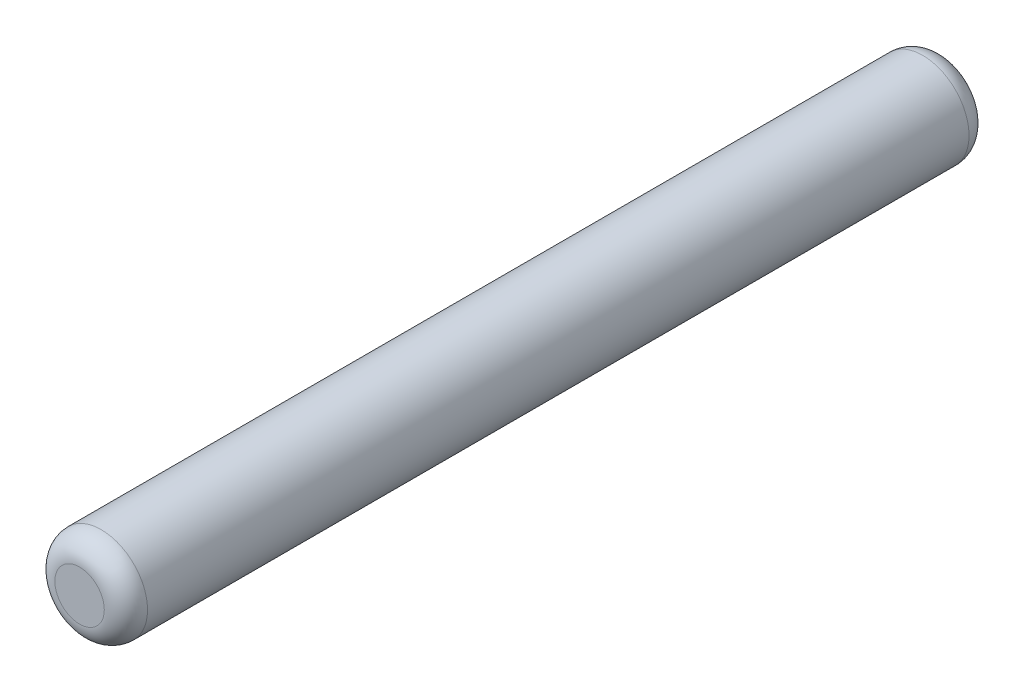
ISO-10303-21;
HEADER;
FILE_DESCRIPTION(('STEP AP214'),'2;1');
FILE_NAME('part.step','',(''),(''),'','','');
FILE_SCHEMA(('AUTOMOTIVE_DESIGN { 1 0 10303 214 1 1 1 1 }'));
ENDSEC;
DATA;
#1=APPLICATION_CONTEXT('core data for automotive mechanical design processes');
#2=APPLICATION_PROTOCOL_DEFINITION('international standard','automotive_design',2000,#1);
#3=PRODUCT_CONTEXT('',#1,'mechanical');
#4=PRODUCT('Part','Part','',(#3));
#5=PRODUCT_RELATED_PRODUCT_CATEGORY('part','',(#4));
#6=PRODUCT_DEFINITION_FORMATION('','',#4);
#7=PRODUCT_DEFINITION_CONTEXT('part definition',#1,'design');
#8=PRODUCT_DEFINITION('design','',#6,#7);
#9=PRODUCT_DEFINITION_SHAPE('','',#8);
#10=(LENGTH_UNIT() NAMED_UNIT(*) SI_UNIT(.MILLI.,.METRE.));
#11=(NAMED_UNIT(*) PLANE_ANGLE_UNIT() SI_UNIT($,.RADIAN.));
#12=(NAMED_UNIT(*) SI_UNIT($,.STERADIAN.) SOLID_ANGLE_UNIT());
#13=UNCERTAINTY_MEASURE_WITH_UNIT(LENGTH_MEASURE(1.E-05),#10,'distance_accuracy_value','');
#14=(GEOMETRIC_REPRESENTATION_CONTEXT(3) GLOBAL_UNCERTAINTY_ASSIGNED_CONTEXT((#13)) GLOBAL_UNIT_ASSIGNED_CONTEXT((#10,
#11,#12)) REPRESENTATION_CONTEXT('',''));
#15=CARTESIAN_POINT('',(0.,0.,0.));
#16=DIRECTION('',(0.,0.,1.));
#17=DIRECTION('',(1.,0.,0.));
#18=AXIS2_PLACEMENT_3D('',#15,#16,#17);
#19=CARTESIAN_POINT('',(0.,0.,7.));
#20=DIRECTION('',(0.,0.,-1.));
#21=DIRECTION('',(-1.,0.,0.));
#22=AXIS2_PLACEMENT_3D('',#19,#20,#21);
#23=CYLINDRICAL_SURFACE('',#22,0.75);
#24=CARTESIAN_POINT('',(0.,0.,-6.65));
#25=DIRECTION('',(0.,0.,1.));
#26=DIRECTION('',(1.,0.,0.));
#27=AXIS2_PLACEMENT_3D('',#24,#25,#26);
#28=CIRCLE('',#27,0.75);
#29=CARTESIAN_POINT('',(0.75,0.,-6.65));
#30=VERTEX_POINT('',#29);
#31=EDGE_CURVE('E42',#30,#30,#28,.T.);
#32=ORIENTED_EDGE('',*,*,#31,.T.);
#33=EDGE_LOOP('',(#32));
#34=FACE_BOUND('',#33,.T.);
#35=CARTESIAN_POINT('',(0.,0.,6.65));
#36=DIRECTION('',(0.,0.,1.));
#37=DIRECTION('',(1.,0.,0.));
#38=AXIS2_PLACEMENT_3D('',#35,#36,#37);
#39=CIRCLE('',#38,0.75);
#40=CARTESIAN_POINT('',(0.75,0.,6.65));
#41=VERTEX_POINT('',#40);
#42=EDGE_CURVE('E46',#41,#41,#39,.F.);
#43=ORIENTED_EDGE('',*,*,#42,.T.);
#44=EDGE_LOOP('',(#43));
#45=FACE_BOUND('',#44,.T.);
#46=ADVANCED_FACE('F31',(#34,#45),#23,.T.);
#47=CARTESIAN_POINT('',(0.,0.,7.));
#48=DIRECTION('',(0.,0.,1.));
#49=DIRECTION('',(1.,0.,0.));
#50=AXIS2_PLACEMENT_3D('',#47,#48,#49);
#51=PLANE('',#50);
#52=CARTESIAN_POINT('',(0.,0.,7.));
#53=DIRECTION('',(0.,0.,1.));
#54=DIRECTION('',(1.,0.,0.));
#55=AXIS2_PLACEMENT_3D('',#52,#53,#54);
#56=CIRCLE('',#55,0.4);
#57=CARTESIAN_POINT('',(0.4,0.,7.));
#58=VERTEX_POINT('',#57);
#59=EDGE_CURVE('E10',#58,#58,#56,.T.);
#60=ORIENTED_EDGE('',*,*,#59,.T.);
#61=EDGE_LOOP('',(#60));
#62=FACE_BOUND('',#61,.T.);
#63=ADVANCED_FACE('F62',(#62),#51,.T.);
#64=CARTESIAN_POINT('',(0.,0.,-7.));
#65=DIRECTION('',(0.,0.,1.));
#66=DIRECTION('',(1.,0.,0.));
#67=AXIS2_PLACEMENT_3D('',#64,#65,#66);
#68=PLANE('',#67);
#69=CARTESIAN_POINT('',(0.,0.,-7.));
#70=DIRECTION('',(0.,0.,1.));
#71=DIRECTION('',(1.,0.,0.));
#72=AXIS2_PLACEMENT_3D('',#69,#70,#71);
#73=CIRCLE('',#72,0.4);
#74=CARTESIAN_POINT('',(0.4,0.,-7.));
#75=VERTEX_POINT('',#74);
#76=EDGE_CURVE('E38',#75,#75,#73,.F.);
#77=ORIENTED_EDGE('',*,*,#76,.T.);
#78=EDGE_LOOP('',(#77));
#79=FACE_BOUND('',#78,.T.);
#80=ADVANCED_FACE('F59',(#79),#68,.F.);
#81=CARTESIAN_POINT('',(0.,0.,-6.65));
#82=DIRECTION('',(0.,0.,1.));
#83=DIRECTION('',(1.,0.,0.));
#84=AXIS2_PLACEMENT_3D('',#81,#82,#83);
#85=TOROIDAL_SURFACE('',#84,0.4,0.35);
#86=ORIENTED_EDGE('',*,*,#76,.F.);
#87=EDGE_LOOP('',(#86));
#88=FACE_BOUND('',#87,.T.);
#89=ORIENTED_EDGE('',*,*,#31,.F.);
#90=EDGE_LOOP('',(#89));
#91=FACE_BOUND('',#90,.T.);
#92=ADVANCED_FACE('F55',(#88,#91),#85,.T.);
#93=CARTESIAN_POINT('',(0.,0.,6.65));
#94=DIRECTION('',(0.,0.,1.));
#95=DIRECTION('',(1.,0.,0.));
#96=AXIS2_PLACEMENT_3D('',#93,#94,#95);
#97=TOROIDAL_SURFACE('',#96,0.4,0.35);
#98=ORIENTED_EDGE('',*,*,#42,.F.);
#99=EDGE_LOOP('',(#98));
#100=FACE_BOUND('',#99,.T.);
#101=ORIENTED_EDGE('',*,*,#59,.F.);
#102=EDGE_LOOP('',(#101));
#103=FACE_BOUND('',#102,.T.);
#104=ADVANCED_FACE('F33',(#100,#103),#97,.T.);
#105=CLOSED_SHELL('',(#46,#63,#80,#92,#104));
#106=MANIFOLD_SOLID_BREP('B2',#105);
#107=ADVANCED_BREP_SHAPE_REPRESENTATION('',(#18,#106),#14);
#108=SHAPE_DEFINITION_REPRESENTATION(#9,#107);
ENDSEC;
END-ISO-10303-21;
